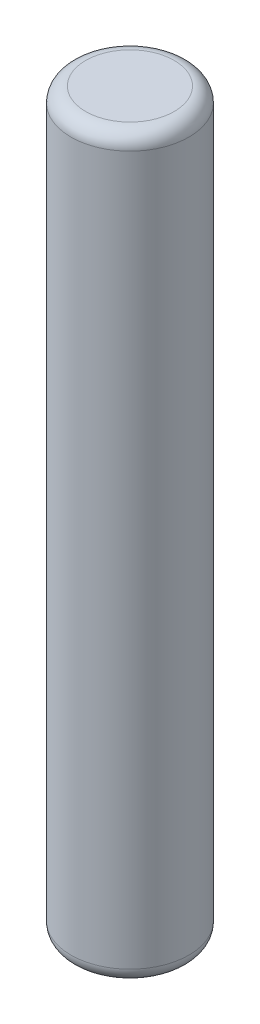
ISO-10303-21;
HEADER;
FILE_DESCRIPTION(('STEP AP214'),'2;1');
FILE_NAME('part.step','',(''),(''),'','','');
FILE_SCHEMA(('AUTOMOTIVE_DESIGN { 1 0 10303 214 1 1 1 1 }'));
ENDSEC;
DATA;
#1=APPLICATION_CONTEXT('core data for automotive mechanical design processes');
#2=APPLICATION_PROTOCOL_DEFINITION('international standard','automotive_design',2000,#1);
#3=PRODUCT_CONTEXT('',#1,'mechanical');
#4=PRODUCT('Part','Part','',(#3));
#5=PRODUCT_RELATED_PRODUCT_CATEGORY('part','',(#4));
#6=PRODUCT_DEFINITION_FORMATION('','',#4);
#7=PRODUCT_DEFINITION_CONTEXT('part definition',#1,'design');
#8=PRODUCT_DEFINITION('design','',#6,#7);
#9=PRODUCT_DEFINITION_SHAPE('','',#8);
#10=(LENGTH_UNIT() NAMED_UNIT(*) SI_UNIT(.MILLI.,.METRE.));
#11=(NAMED_UNIT(*) PLANE_ANGLE_UNIT() SI_UNIT($,.RADIAN.));
#12=(NAMED_UNIT(*) SI_UNIT($,.STERADIAN.) SOLID_ANGLE_UNIT());
#13=UNCERTAINTY_MEASURE_WITH_UNIT(LENGTH_MEASURE(1.E-05),#10,'distance_accuracy_value','');
#14=(GEOMETRIC_REPRESENTATION_CONTEXT(3) GLOBAL_UNCERTAINTY_ASSIGNED_CONTEXT((#13)) GLOBAL_UNIT_ASSIGNED_CONTEXT((#10,
#11,#12)) REPRESENTATION_CONTEXT('',''));
#15=CARTESIAN_POINT('',(0.,0.,0.));
#16=DIRECTION('',(0.,0.,1.));
#17=DIRECTION('',(1.,0.,0.));
#18=AXIS2_PLACEMENT_3D('',#15,#16,#17);
#19=CARTESIAN_POINT('',(0.,50.,0.));
#20=DIRECTION('',(0.,-1.,0.));
#21=DIRECTION('',(0.,0.,-1.));
#22=AXIS2_PLACEMENT_3D('',#19,#20,#21);
#23=CYLINDRICAL_SURFACE('',#22,4.);
#24=CARTESIAN_POINT('',(0.,1.,0.));
#25=DIRECTION('',(0.,1.,0.));
#26=DIRECTION('',(0.,0.,1.));
#27=AXIS2_PLACEMENT_3D('',#24,#25,#26);
#28=CIRCLE('',#27,4.);
#29=CARTESIAN_POINT('',(0.,1.,4.));
#30=VERTEX_POINT('',#29);
#31=EDGE_CURVE('E39',#30,#30,#28,.T.);
#32=ORIENTED_EDGE('',*,*,#31,.T.);
#33=EDGE_LOOP('',(#32));
#34=FACE_BOUND('',#33,.T.);
#35=CARTESIAN_POINT('',(0.,49.,0.));
#36=DIRECTION('',(0.,1.,0.));
#37=DIRECTION('',(0.,0.,1.));
#38=AXIS2_PLACEMENT_3D('',#35,#36,#37);
#39=CIRCLE('',#38,4.);
#40=CARTESIAN_POINT('',(0.,49.,4.));
#41=VERTEX_POINT('',#40);
#42=EDGE_CURVE('E43',#41,#41,#39,.F.);
#43=ORIENTED_EDGE('',*,*,#42,.T.);
#44=EDGE_LOOP('',(#43));
#45=FACE_BOUND('',#44,.T.);
#46=ADVANCED_FACE('F32',(#34,#45),#23,.T.);
#47=CARTESIAN_POINT('',(0.,50.,0.));
#48=DIRECTION('',(0.,1.,0.));
#49=DIRECTION('',(0.,0.,1.));
#50=AXIS2_PLACEMENT_3D('',#47,#48,#49);
#51=PLANE('',#50);
#52=CARTESIAN_POINT('',(0.,50.,0.));
#53=DIRECTION('',(0.,1.,0.));
#54=DIRECTION('',(0.,0.,1.));
#55=AXIS2_PLACEMENT_3D('',#52,#53,#54);
#56=CIRCLE('',#55,3.);
#57=CARTESIAN_POINT('',(0.,50.,3.));
#58=VERTEX_POINT('',#57);
#59=EDGE_CURVE('E47',#58,#58,#56,.T.);
#60=ORIENTED_EDGE('',*,*,#59,.T.);
#61=EDGE_LOOP('',(#60));
#62=FACE_BOUND('',#61,.T.);
#63=ADVANCED_FACE('F53',(#62),#51,.T.);
#64=CARTESIAN_POINT('',(0.,0.,0.));
#65=DIRECTION('',(0.,1.,0.));
#66=DIRECTION('',(0.,0.,1.));
#67=AXIS2_PLACEMENT_3D('',#64,#65,#66);
#68=PLANE('',#67);
#69=CARTESIAN_POINT('',(0.,0.,0.));
#70=DIRECTION('',(0.,1.,0.));
#71=DIRECTION('',(0.,0.,1.));
#72=AXIS2_PLACEMENT_3D('',#69,#70,#71);
#73=CIRCLE('',#72,3.);
#74=CARTESIAN_POINT('',(0.,0.,3.));
#75=VERTEX_POINT('',#74);
#76=EDGE_CURVE('E10',#75,#75,#73,.F.);
#77=ORIENTED_EDGE('',*,*,#76,.T.);
#78=EDGE_LOOP('',(#77));
#79=FACE_BOUND('',#78,.T.);
#80=ADVANCED_FACE('F57',(#79),#68,.F.);
#81=CARTESIAN_POINT('',(0.,49.,0.));
#82=DIRECTION('',(0.,1.,0.));
#83=DIRECTION('',(0.,0.,1.));
#84=AXIS2_PLACEMENT_3D('',#81,#82,#83);
#85=TOROIDAL_SURFACE('',#84,3.,1.);
#86=ORIENTED_EDGE('',*,*,#42,.F.);
#87=EDGE_LOOP('',(#86));
#88=FACE_BOUND('',#87,.T.);
#89=ORIENTED_EDGE('',*,*,#59,.F.);
#90=EDGE_LOOP('',(#89));
#91=FACE_BOUND('',#90,.T.);
#92=ADVANCED_FACE('F55',(#88,#91),#85,.T.);
#93=CARTESIAN_POINT('',(0.,1.,0.));
#94=DIRECTION('',(0.,1.,0.));
#95=DIRECTION('',(0.,0.,1.));
#96=AXIS2_PLACEMENT_3D('',#93,#94,#95);
#97=TOROIDAL_SURFACE('',#96,3.,1.);
#98=ORIENTED_EDGE('',*,*,#76,.F.);
#99=EDGE_LOOP('',(#98));
#100=FACE_BOUND('',#99,.T.);
#101=ORIENTED_EDGE('',*,*,#31,.F.);
#102=EDGE_LOOP('',(#101));
#103=FACE_BOUND('',#102,.T.);
#104=ADVANCED_FACE('F34',(#100,#103),#97,.T.);
#105=CLOSED_SHELL('',(#46,#63,#80,#92,#104));
#106=MANIFOLD_SOLID_BREP('B2',#105);
#107=ADVANCED_BREP_SHAPE_REPRESENTATION('',(#18,#106),#14);
#108=SHAPE_DEFINITION_REPRESENTATION(#9,#107);
ENDSEC;
END-ISO-10303-21;
